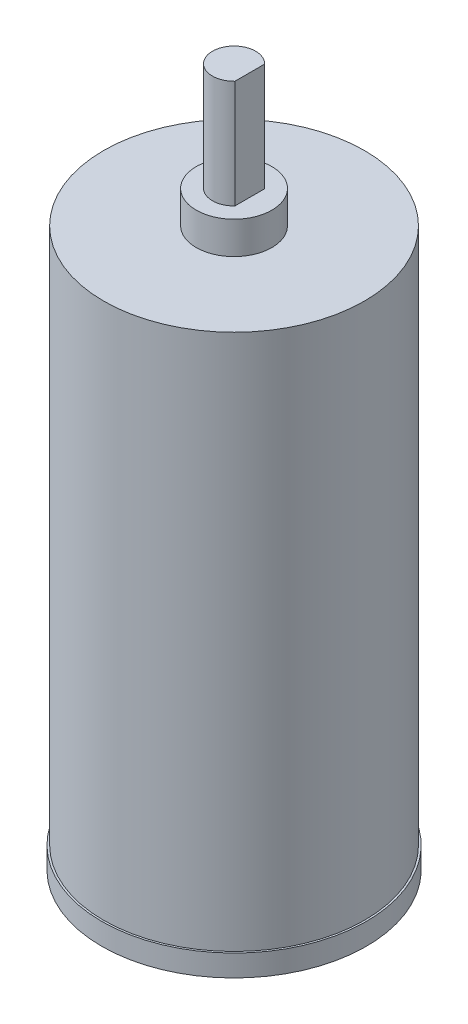
ISO-10303-21;
HEADER;
FILE_DESCRIPTION(('STEP AP214'),'2;1');
FILE_NAME('part.step','',(''),(''),'','','');
FILE_SCHEMA(('AUTOMOTIVE_DESIGN { 1 0 10303 214 1 1 1 1 }'));
ENDSEC;
DATA;
#1=APPLICATION_CONTEXT('core data for automotive mechanical design processes');
#2=APPLICATION_PROTOCOL_DEFINITION('international standard','automotive_design',2000,#1);
#3=PRODUCT_CONTEXT('',#1,'mechanical');
#4=PRODUCT('Part','Part','',(#3));
#5=PRODUCT_RELATED_PRODUCT_CATEGORY('part','',(#4));
#6=PRODUCT_DEFINITION_FORMATION('','',#4);
#7=PRODUCT_DEFINITION_CONTEXT('part definition',#1,'design');
#8=PRODUCT_DEFINITION('design','',#6,#7);
#9=PRODUCT_DEFINITION_SHAPE('','',#8);
#10=(LENGTH_UNIT() NAMED_UNIT(*) SI_UNIT(.MILLI.,.METRE.));
#11=(NAMED_UNIT(*) PLANE_ANGLE_UNIT() SI_UNIT($,.RADIAN.));
#12=(NAMED_UNIT(*) SI_UNIT($,.STERADIAN.) SOLID_ANGLE_UNIT());
#13=UNCERTAINTY_MEASURE_WITH_UNIT(LENGTH_MEASURE(1.E-05),#10,'distance_accuracy_value','');
#14=(GEOMETRIC_REPRESENTATION_CONTEXT(3) GLOBAL_UNCERTAINTY_ASSIGNED_CONTEXT((#13)) GLOBAL_UNIT_ASSIGNED_CONTEXT((#10,
#11,#12)) REPRESENTATION_CONTEXT('',''));
#15=CARTESIAN_POINT('',(0.,0.,0.));
#16=DIRECTION('',(0.,0.,1.));
#17=DIRECTION('',(1.,0.,0.));
#18=AXIS2_PLACEMENT_3D('',#15,#16,#17);
#19=CARTESIAN_POINT('',(0.,2.,0.));
#20=DIRECTION('',(0.,-1.,0.));
#21=DIRECTION('',(0.,0.,-1.));
#22=AXIS2_PLACEMENT_3D('',#19,#20,#21);
#23=CYLINDRICAL_SURFACE('',#22,12.25);
#24=CARTESIAN_POINT('',(0.,2.,0.));
#25=DIRECTION('',(0.,1.,0.));
#26=DIRECTION('',(0.,0.,1.));
#27=AXIS2_PLACEMENT_3D('',#24,#25,#26);
#28=CIRCLE('',#27,12.25);
#29=CARTESIAN_POINT('',(0.,2.,12.25));
#30=VERTEX_POINT('',#29);
#31=EDGE_CURVE('E48',#30,#30,#28,.T.);
#32=ORIENTED_EDGE('',*,*,#31,.F.);
#33=EDGE_LOOP('',(#32));
#34=FACE_BOUND('',#33,.T.);
#35=CARTESIAN_POINT('',(0.,0.,0.));
#36=DIRECTION('',(0.,1.,0.));
#37=DIRECTION('',(0.,0.,1.));
#38=AXIS2_PLACEMENT_3D('',#35,#36,#37);
#39=CIRCLE('',#38,12.25);
#40=CARTESIAN_POINT('',(0.,0.,12.25));
#41=VERTEX_POINT('',#40);
#42=EDGE_CURVE('E42',#41,#41,#39,.T.);
#43=ORIENTED_EDGE('',*,*,#42,.T.);
#44=EDGE_LOOP('',(#43));
#45=FACE_BOUND('',#44,.T.);
#46=ADVANCED_FACE('F39',(#34,#45),#23,.T.);
#47=CARTESIAN_POINT('',(0.,2.,0.));
#48=DIRECTION('',(0.,1.,0.));
#49=DIRECTION('',(0.,0.,1.));
#50=AXIS2_PLACEMENT_3D('',#47,#48,#49);
#51=PLANE('',#50);
#52=CARTESIAN_POINT('',(0.,2.,0.));
#53=DIRECTION('',(0.,1.,0.));
#54=DIRECTION('',(0.,0.,1.));
#55=AXIS2_PLACEMENT_3D('',#52,#53,#54);
#56=CIRCLE('',#55,12.075);
#57=CARTESIAN_POINT('',(0.,2.,12.075));
#58=VERTEX_POINT('',#57);
#59=EDGE_CURVE('E100',#58,#58,#56,.F.);
#60=ORIENTED_EDGE('',*,*,#59,.T.);
#61=EDGE_LOOP('',(#60));
#62=FACE_BOUND('',#61,.T.);
#63=ORIENTED_EDGE('',*,*,#31,.T.);
#64=EDGE_LOOP('',(#63));
#65=FACE_BOUND('',#64,.T.);
#66=ADVANCED_FACE('F115',(#62,#65),#51,.T.);
#67=CARTESIAN_POINT('',(0.,0.,0.));
#68=DIRECTION('',(0.,1.,0.));
#69=DIRECTION('',(0.,0.,1.));
#70=AXIS2_PLACEMENT_3D('',#67,#68,#69);
#71=PLANE('',#70);
#72=ORIENTED_EDGE('',*,*,#42,.F.);
#73=EDGE_LOOP('',(#72));
#74=FACE_BOUND('',#73,.T.);
#75=ADVANCED_FACE('F112',(#74),#71,.F.);
#76=CARTESIAN_POINT('',(0.,51.65,0.));
#77=DIRECTION('',(0.,-1.,0.));
#78=DIRECTION('',(0.,0.,-1.));
#79=AXIS2_PLACEMENT_3D('',#76,#77,#78);
#80=CYLINDRICAL_SURFACE('',#79,12.075);
#81=ORIENTED_EDGE('',*,*,#59,.F.);
#82=EDGE_LOOP('',(#81));
#83=FACE_BOUND('',#82,.T.);
#84=CARTESIAN_POINT('',(0.,51.65,0.));
#85=DIRECTION('',(0.,1.,0.));
#86=DIRECTION('',(0.,0.,1.));
#87=AXIS2_PLACEMENT_3D('',#84,#85,#86);
#88=CIRCLE('',#87,12.075);
#89=CARTESIAN_POINT('',(0.,51.65,12.075));
#90=VERTEX_POINT('',#89);
#91=EDGE_CURVE('E95',#90,#90,#88,.T.);
#92=ORIENTED_EDGE('',*,*,#91,.F.);
#93=EDGE_LOOP('',(#92));
#94=FACE_BOUND('',#93,.T.);
#95=ADVANCED_FACE('F114',(#83,#94),#80,.T.);
#96=CARTESIAN_POINT('',(0.,51.65,0.));
#97=DIRECTION('',(0.,1.,0.));
#98=DIRECTION('',(0.,0.,1.));
#99=AXIS2_PLACEMENT_3D('',#96,#97,#98);
#100=PLANE('',#99);
#101=CARTESIAN_POINT('',(0.,51.65,0.));
#102=DIRECTION('',(0.,1.,0.));
#103=DIRECTION('',(0.,0.,1.));
#104=AXIS2_PLACEMENT_3D('',#101,#102,#103);
#105=CIRCLE('',#104,3.5);
#106=CARTESIAN_POINT('',(0.,51.65,3.5));
#107=VERTEX_POINT('',#106);
#108=EDGE_CURVE('E11',#107,#107,#105,.T.);
#109=ORIENTED_EDGE('',*,*,#108,.F.);
#110=EDGE_LOOP('',(#109));
#111=FACE_BOUND('',#110,.T.);
#112=ORIENTED_EDGE('',*,*,#91,.T.);
#113=EDGE_LOOP('',(#112));
#114=FACE_BOUND('',#113,.T.);
#115=ADVANCED_FACE('F120',(#111,#114),#100,.T.);
#116=CARTESIAN_POINT('',(0.,54.65,0.));
#117=DIRECTION('',(0.,-1.,0.));
#118=DIRECTION('',(0.,0.,-1.));
#119=AXIS2_PLACEMENT_3D('',#116,#117,#118);
#120=CYLINDRICAL_SURFACE('',#119,3.5);
#121=CARTESIAN_POINT('',(0.,54.65,0.));
#122=DIRECTION('',(0.,1.,0.));
#123=DIRECTION('',(0.,0.,1.));
#124=AXIS2_PLACEMENT_3D('',#121,#122,#123);
#125=CIRCLE('',#124,3.5);
#126=CARTESIAN_POINT('',(0.,54.65,3.5));
#127=VERTEX_POINT('',#126);
#128=EDGE_CURVE('E89',#127,#127,#125,.T.);
#129=ORIENTED_EDGE('',*,*,#128,.F.);
#130=EDGE_LOOP('',(#129));
#131=FACE_BOUND('',#130,.T.);
#132=ORIENTED_EDGE('',*,*,#108,.T.);
#133=EDGE_LOOP('',(#132));
#134=FACE_BOUND('',#133,.T.);
#135=ADVANCED_FACE('F152',(#131,#134),#120,.T.);
#136=CARTESIAN_POINT('',(0.,54.65,0.));
#137=DIRECTION('',(0.,1.,0.));
#138=DIRECTION('',(0.,0.,1.));
#139=AXIS2_PLACEMENT_3D('',#136,#137,#138);
#140=PLANE('',#139);
#141=DIRECTION('',(0.,0.,-1.));
#142=VECTOR('',#141,1.);
#143=CARTESIAN_POINT('',(1.45,54.65,0.));
#144=LINE('',#143,#142);
#145=CARTESIAN_POINT('',(1.45,54.65,1.37749773139559));
#146=VERTEX_POINT('',#145);
#147=CARTESIAN_POINT('',(1.45,54.65,-1.37749773139559));
#148=VERTEX_POINT('',#147);
#149=EDGE_CURVE('E67',#146,#148,#144,.T.);
#150=ORIENTED_EDGE('',*,*,#149,.F.);
#151=CARTESIAN_POINT('',(0.,54.65,0.));
#152=DIRECTION('',(0.,1.,0.));
#153=DIRECTION('',(0.,0.,1.));
#154=AXIS2_PLACEMENT_3D('',#151,#152,#153);
#155=CIRCLE('',#154,2.);
#156=EDGE_CURVE('E55',#148,#146,#155,.T.);
#157=ORIENTED_EDGE('',*,*,#156,.F.);
#158=EDGE_LOOP('',(#150,#157));
#159=FACE_BOUND('',#158,.T.);
#160=ORIENTED_EDGE('',*,*,#128,.T.);
#161=EDGE_LOOP('',(#160));
#162=FACE_BOUND('',#161,.T.);
#163=ADVANCED_FACE('F68',(#159,#162),#140,.T.);
#164=CARTESIAN_POINT('',(1.45,64.65,0.));
#165=DIRECTION('',(-1.,0.,0.));
#166=DIRECTION('',(0.,0.,1.));
#167=AXIS2_PLACEMENT_3D('',#164,#165,#166);
#168=PLANE('',#167);
#169=ORIENTED_EDGE('',*,*,#149,.T.);
#170=DIRECTION('',(0.,-1.,0.));
#171=VECTOR('',#170,1.);
#172=CARTESIAN_POINT('',(1.45,64.65,-1.37749773139559));
#173=LINE('',#172,#171);
#174=CARTESIAN_POINT('',(1.45,64.65,-1.37749773139559));
#175=VERTEX_POINT('',#174);
#176=EDGE_CURVE('E80',#175,#148,#173,.T.);
#177=ORIENTED_EDGE('',*,*,#176,.F.);
#178=DIRECTION('',(0.,0.,-1.));
#179=VECTOR('',#178,1.);
#180=CARTESIAN_POINT('',(1.45,64.65,0.));
#181=LINE('',#180,#179);
#182=CARTESIAN_POINT('',(1.45,64.65,1.37749773139559));
#183=VERTEX_POINT('',#182);
#184=EDGE_CURVE('E82',#183,#175,#181,.T.);
#185=ORIENTED_EDGE('',*,*,#184,.F.);
#186=DIRECTION('',(0.,-1.,0.));
#187=VECTOR('',#186,1.);
#188=CARTESIAN_POINT('',(1.45,64.65,1.37749773139559));
#189=LINE('',#188,#187);
#190=EDGE_CURVE('E78',#183,#146,#189,.T.);
#191=ORIENTED_EDGE('',*,*,#190,.T.);
#192=EDGE_LOOP('',(#169,#177,#185,#191));
#193=FACE_BOUND('',#192,.T.);
#194=ADVANCED_FACE('F84',(#193),#168,.F.);
#195=CARTESIAN_POINT('',(0.,64.65,0.));
#196=DIRECTION('',(0.,-1.,0.));
#197=DIRECTION('',(0.,0.,-1.));
#198=AXIS2_PLACEMENT_3D('',#195,#196,#197);
#199=CYLINDRICAL_SURFACE('',#198,2.);
#200=ORIENTED_EDGE('',*,*,#156,.T.);
#201=ORIENTED_EDGE('',*,*,#190,.F.);
#202=CARTESIAN_POINT('',(0.,64.65,0.));
#203=DIRECTION('',(0.,1.,0.));
#204=DIRECTION('',(0.,0.,1.));
#205=AXIS2_PLACEMENT_3D('',#202,#203,#204);
#206=CIRCLE('',#205,2.);
#207=EDGE_CURVE('E63',#175,#183,#206,.T.);
#208=ORIENTED_EDGE('',*,*,#207,.F.);
#209=ORIENTED_EDGE('',*,*,#176,.T.);
#210=EDGE_LOOP('',(#200,#201,#208,#209));
#211=FACE_BOUND('',#210,.T.);
#212=ADVANCED_FACE('F77',(#211),#199,.T.);
#213=CARTESIAN_POINT('',(0.,64.65,0.));
#214=DIRECTION('',(0.,1.,0.));
#215=DIRECTION('',(0.,0.,1.));
#216=AXIS2_PLACEMENT_3D('',#213,#214,#215);
#217=PLANE('',#216);
#218=ORIENTED_EDGE('',*,*,#184,.T.);
#219=ORIENTED_EDGE('',*,*,#207,.T.);
#220=EDGE_LOOP('',(#218,#219));
#221=FACE_BOUND('',#220,.T.);
#222=ADVANCED_FACE('F188',(#221),#217,.T.);
#223=CLOSED_SHELL('',(#46,#66,#75,#95,#115,#135,#163,#194,#212,#222));
#224=MANIFOLD_SOLID_BREP('B2',#223);
#225=ADVANCED_BREP_SHAPE_REPRESENTATION('',(#18,#224),#14);
#226=SHAPE_DEFINITION_REPRESENTATION(#9,#225);
ENDSEC;
END-ISO-10303-21;
